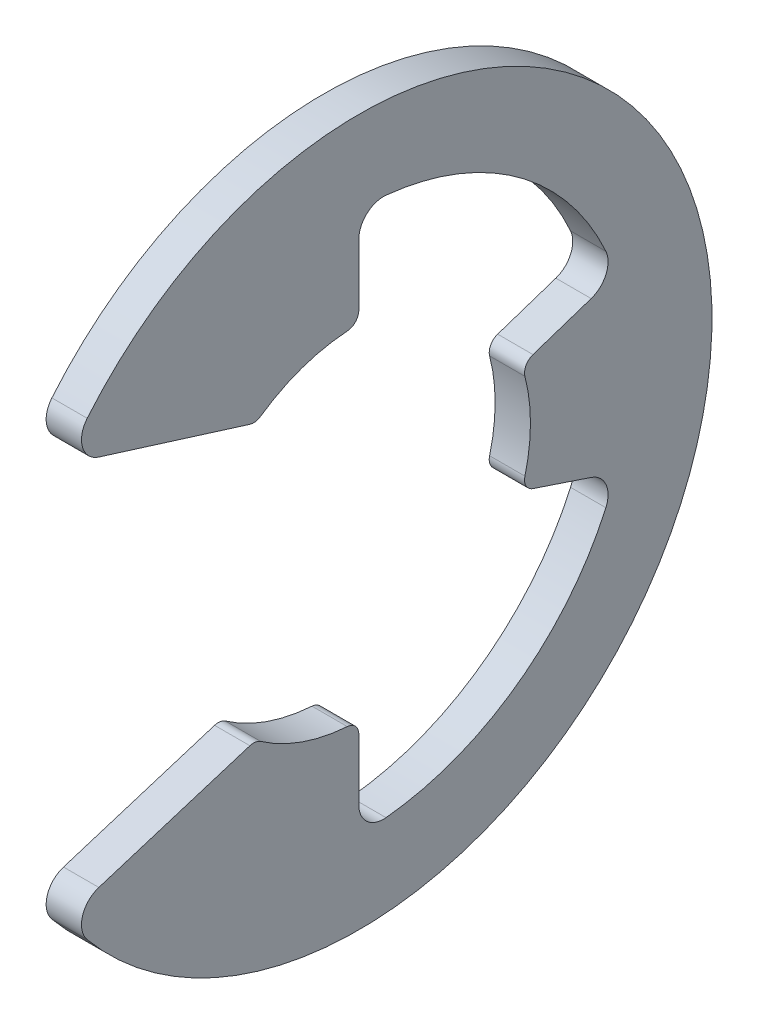
ISO-10303-21;
HEADER;
FILE_DESCRIPTION(('STEP AP214'),'2;1');
FILE_NAME('part.step','',(''),(''),'','','');
FILE_SCHEMA(('AUTOMOTIVE_DESIGN { 1 0 10303 214 1 1 1 1 }'));
ENDSEC;
DATA;
#1=APPLICATION_CONTEXT('core data for automotive mechanical design processes');
#2=APPLICATION_PROTOCOL_DEFINITION('international standard','automotive_design',2000,#1);
#3=PRODUCT_CONTEXT('',#1,'mechanical');
#4=PRODUCT('Part','Part','',(#3));
#5=PRODUCT_RELATED_PRODUCT_CATEGORY('part','',(#4));
#6=PRODUCT_DEFINITION_FORMATION('','',#4);
#7=PRODUCT_DEFINITION_CONTEXT('part definition',#1,'design');
#8=PRODUCT_DEFINITION('design','',#6,#7);
#9=PRODUCT_DEFINITION_SHAPE('','',#8);
#10=(LENGTH_UNIT() NAMED_UNIT(*) SI_UNIT(.MILLI.,.METRE.));
#11=(NAMED_UNIT(*) PLANE_ANGLE_UNIT() SI_UNIT($,.RADIAN.));
#12=(NAMED_UNIT(*) SI_UNIT($,.STERADIAN.) SOLID_ANGLE_UNIT());
#13=UNCERTAINTY_MEASURE_WITH_UNIT(LENGTH_MEASURE(1.E-05),#10,'distance_accuracy_value','');
#14=(GEOMETRIC_REPRESENTATION_CONTEXT(3) GLOBAL_UNCERTAINTY_ASSIGNED_CONTEXT((#13)) GLOBAL_UNIT_ASSIGNED_CONTEXT((#10,
#11,#12)) REPRESENTATION_CONTEXT('',''));
#15=CARTESIAN_POINT('',(0.,0.,0.));
#16=DIRECTION('',(0.,0.,1.));
#17=DIRECTION('',(1.,0.,0.));
#18=AXIS2_PLACEMENT_3D('',#15,#16,#17);
#19=CARTESIAN_POINT('',(0.3175,0.,0.));
#20=DIRECTION('',(-1.,0.,0.));
#21=DIRECTION('',(0.,0.,1.));
#22=AXIS2_PLACEMENT_3D('',#19,#20,#21);
#23=CYLINDRICAL_SURFACE('',#22,3.0861);
#24=CARTESIAN_POINT('',(0.3175,0.,0.));
#25=DIRECTION('',(-1.,0.,0.));
#26=DIRECTION('',(0.,0.,-1.));
#27=AXIS2_PLACEMENT_3D('',#24,#25,#26);
#28=CIRCLE('',#27,3.0861);
#29=CARTESIAN_POINT('',(0.3175,0.777025279538533,-2.98667790780293));
#30=VERTEX_POINT('',#29);
#31=CARTESIAN_POINT('',(0.3175,-0.777025279538533,-2.98667790780293));
#32=VERTEX_POINT('',#31);
#33=EDGE_CURVE('E263',#30,#32,#28,.T.);
#34=ORIENTED_EDGE('',*,*,#33,.F.);
#35=DIRECTION('',(-1.,0.,0.));
#36=VECTOR('',#35,1.);
#37=CARTESIAN_POINT('',(0.3175,0.777025279538533,-2.98667790780293));
#38=LINE('',#37,#36);
#39=CARTESIAN_POINT('',(-0.3175,0.777025279538533,-2.98667790780293));
#40=VERTEX_POINT('',#39);
#41=EDGE_CURVE('E428',#30,#40,#38,.T.);
#42=ORIENTED_EDGE('',*,*,#41,.T.);
#43=CARTESIAN_POINT('',(-0.3175,0.,0.));
#44=DIRECTION('',(-1.,0.,0.));
#45=DIRECTION('',(0.,0.,-1.));
#46=AXIS2_PLACEMENT_3D('',#43,#44,#45);
#47=CIRCLE('',#46,3.0861);
#48=CARTESIAN_POINT('',(-0.3175,-0.777025279538533,-2.98667790780293));
#49=VERTEX_POINT('',#48);
#50=EDGE_CURVE('E494',#40,#49,#47,.T.);
#51=ORIENTED_EDGE('',*,*,#50,.T.);
#52=DIRECTION('',(-1.,0.,0.));
#53=VECTOR('',#52,1.);
#54=CARTESIAN_POINT('',(0.3175,-0.777025279538533,-2.98667790780293));
#55=LINE('',#54,#53);
#56=EDGE_CURVE('E67',#49,#32,#55,.F.);
#57=ORIENTED_EDGE('',*,*,#56,.T.);
#58=EDGE_LOOP('',(#34,#42,#51,#57));
#59=FACE_BOUND('',#58,.T.);
#60=ADVANCED_FACE('F43',(#59),#23,.F.);
#61=CARTESIAN_POINT('',(0.3175,-0.975910508704563,-2.92773152611369));
#62=DIRECTION('',(0.,0.948683298050514,-0.316227766016838));
#63=DIRECTION('',(0.,0.316227766016838,0.948683298050514));
#64=AXIS2_PLACEMENT_3D('',#61,#62,#63);
#65=PLANE('',#64);
#66=DIRECTION('',(0.,-0.316227766016838,-0.948683298050514));
#67=VECTOR('',#66,1.);
#68=CARTESIAN_POINT('',(0.3175,-0.975910508704563,-2.92773152611369));
#69=LINE('',#68,#67);
#70=CARTESIAN_POINT('',(0.3175,-1.04382875319661,-3.13148625958984));
#71=VERTEX_POINT('',#70);
#72=CARTESIAN_POINT('',(0.3175,-1.39246687510636,-4.17740062531908));
#73=VERTEX_POINT('',#72);
#74=EDGE_CURVE('E266',#71,#73,#69,.T.);
#75=ORIENTED_EDGE('',*,*,#74,.F.);
#76=DIRECTION('',(-1.,0.,0.));
#77=VECTOR('',#76,1.);
#78=CARTESIAN_POINT('',(0.3175,-1.04382875319661,-3.13148625958984));
#79=LINE('',#78,#77);
#80=CARTESIAN_POINT('',(-0.3175,-1.04382875319661,-3.13148625958984));
#81=VERTEX_POINT('',#80);
#82=EDGE_CURVE('E435',#71,#81,#79,.T.);
#83=ORIENTED_EDGE('',*,*,#82,.T.);
#84=DIRECTION('',(0.,-0.316227766016838,-0.948683298050514));
#85=VECTOR('',#84,1.);
#86=CARTESIAN_POINT('',(-0.3175,-0.975910508704563,-2.92773152611369));
#87=LINE('',#86,#85);
#88=CARTESIAN_POINT('',(-0.3175,-1.39246687510636,-4.17740062531908));
#89=VERTEX_POINT('',#88);
#90=EDGE_CURVE('E497',#81,#89,#87,.T.);
#91=ORIENTED_EDGE('',*,*,#90,.T.);
#92=DIRECTION('',(1.,0.,0.));
#93=VECTOR('',#92,1.);
#94=CARTESIAN_POINT('',(0.3175,-1.39246687510636,-4.17740062531908));
#95=LINE('',#94,#93);
#96=EDGE_CURVE('E332',#89,#73,#95,.T.);
#97=ORIENTED_EDGE('',*,*,#96,.T.);
#98=EDGE_LOOP('',(#75,#83,#91,#97));
#99=FACE_BOUND('',#98,.T.);
#100=ADVANCED_FACE('F539',(#99),#65,.F.);
#101=CARTESIAN_POINT('',(0.3175,0.,0.));
#102=DIRECTION('',(-1.,0.,0.));
#103=DIRECTION('',(0.,0.,1.));
#104=AXIS2_PLACEMENT_3D('',#101,#102,#103);
#105=CYLINDRICAL_SURFACE('',#104,4.87024516129032);
#106=CARTESIAN_POINT('',(-0.3175,0.,0.));
#107=DIRECTION('',(-1.,0.,0.));
#108=DIRECTION('',(0.,0.,-1.));
#109=AXIS2_PLACEMENT_3D('',#106,#107,#108);
#110=CIRCLE('',#109,4.87024516129032);
#111=CARTESIAN_POINT('',(-0.3175,-1.99636153603219,-4.44227740562462));
#112=VERTEX_POINT('',#111);
#113=CARTESIAN_POINT('',(-0.3175,-4.84561932872465,-0.489143386096454));
#114=VERTEX_POINT('',#113);
#115=EDGE_CURVE('E501',#112,#114,#110,.T.);
#116=ORIENTED_EDGE('',*,*,#115,.T.);
#117=DIRECTION('',(-1.,0.,0.));
#118=VECTOR('',#117,1.);
#119=CARTESIAN_POINT('',(0.3175,-4.84561932872465,-0.489143386096454));
#120=LINE('',#119,#118);
#121=CARTESIAN_POINT('',(0.3175,-4.84561932872465,-0.489143386096454));
#122=VERTEX_POINT('',#121);
#123=EDGE_CURVE('E329',#114,#122,#120,.F.);
#124=ORIENTED_EDGE('',*,*,#123,.T.);
#125=CARTESIAN_POINT('',(0.3175,0.,0.));
#126=DIRECTION('',(-1.,0.,0.));
#127=DIRECTION('',(0.,0.,-1.));
#128=AXIS2_PLACEMENT_3D('',#125,#126,#127);
#129=CIRCLE('',#128,4.87024516129032);
#130=CARTESIAN_POINT('',(0.3175,-1.99636153603219,-4.44227740562462));
#131=VERTEX_POINT('',#130);
#132=EDGE_CURVE('E269',#131,#122,#129,.T.);
#133=ORIENTED_EDGE('',*,*,#132,.F.);
#134=DIRECTION('',(-1.,0.,0.));
#135=VECTOR('',#134,1.);
#136=CARTESIAN_POINT('',(0.3175,-1.99636153603219,-4.44227740562462));
#137=LINE('',#136,#135);
#138=EDGE_CURVE('E325',#131,#112,#137,.T.);
#139=ORIENTED_EDGE('',*,*,#138,.T.);
#140=EDGE_LOOP('',(#116,#124,#133,#139));
#141=FACE_BOUND('',#140,.T.);
#142=ADVANCED_FACE('F544',(#141),#105,.F.);
#143=CARTESIAN_POINT('',(0.3175,-4.87024516129032,0.));
#144=DIRECTION('',(0.,0.,1.));
#145=DIRECTION('',(0.,-1.,0.));
#146=AXIS2_PLACEMENT_3D('',#143,#144,#145);
#147=PLANE('',#146);
#148=DIRECTION('',(0.,1.,0.));
#149=VECTOR('',#148,1.);
#150=CARTESIAN_POINT('',(-0.3175,-4.87024516129032,0.));
#151=LINE('',#150,#149);
#152=CARTESIAN_POINT('',(-0.3175,-4.40336689167331,0.));
#153=VERTEX_POINT('',#152);
#154=CARTESIAN_POINT('',(-0.3175,-3.30087634727507,0.));
#155=VERTEX_POINT('',#154);
#156=EDGE_CURVE('E507',#153,#155,#151,.T.);
#157=ORIENTED_EDGE('',*,*,#156,.T.);
#158=DIRECTION('',(-1.,0.,0.));
#159=VECTOR('',#158,1.);
#160=CARTESIAN_POINT('',(0.3175,-3.30087634727507,0.));
#161=LINE('',#160,#159);
#162=CARTESIAN_POINT('',(0.3175,-3.30087634727507,0.));
#163=VERTEX_POINT('',#162);
#164=EDGE_CURVE('E402',#155,#163,#161,.F.);
#165=ORIENTED_EDGE('',*,*,#164,.T.);
#166=DIRECTION('',(0.,1.,0.));
#167=VECTOR('',#166,1.);
#168=CARTESIAN_POINT('',(0.3175,-4.87024516129032,0.));
#169=LINE('',#168,#167);
#170=CARTESIAN_POINT('',(0.3175,-4.40336689167331,0.));
#171=VERTEX_POINT('',#170);
#172=EDGE_CURVE('E273',#171,#163,#169,.T.);
#173=ORIENTED_EDGE('',*,*,#172,.F.);
#174=DIRECTION('',(1.,0.,0.));
#175=VECTOR('',#174,1.);
#176=CARTESIAN_POINT('',(-0.3175,-4.40336689167331,0.));
#177=LINE('',#176,#175);
#178=EDGE_CURVE('E321',#171,#153,#177,.F.);
#179=ORIENTED_EDGE('',*,*,#178,.T.);
#180=EDGE_LOOP('',(#157,#165,#173,#179));
#181=FACE_BOUND('',#180,.T.);
#182=ADVANCED_FACE('F550',(#181),#147,.F.);
#183=CARTESIAN_POINT('',(0.3175,0.,0.));
#184=DIRECTION('',(-1.,0.,0.));
#185=DIRECTION('',(0.,0.,1.));
#186=AXIS2_PLACEMENT_3D('',#183,#184,#185);
#187=CYLINDRICAL_SURFACE('',#186,3.0861);
#188=CARTESIAN_POINT('',(0.3175,0.,0.));
#189=DIRECTION('',(-1.,0.,0.));
#190=DIRECTION('',(0.,0.,-1.));
#191=AXIS2_PLACEMENT_3D('',#188,#189,#190);
#192=CIRCLE('',#191,3.0861);
#193=CARTESIAN_POINT('',(0.3175,-3.07912841607617,0.207319577735125));
#194=VERTEX_POINT('',#193);
#195=CARTESIAN_POINT('',(0.3175,-2.53187030116757,1.76455263114072));
#196=VERTEX_POINT('',#195);
#197=EDGE_CURVE('E277',#194,#196,#192,.T.);
#198=ORIENTED_EDGE('',*,*,#197,.F.);
#199=DIRECTION('',(-1.,0.,0.));
#200=VECTOR('',#199,1.);
#201=CARTESIAN_POINT('',(0.3175,-3.07912841607617,0.207319577735125));
#202=LINE('',#201,#200);
#203=CARTESIAN_POINT('',(-0.3175,-3.07912841607617,0.207319577735125));
#204=VERTEX_POINT('',#203);
#205=EDGE_CURVE('E380',#194,#204,#202,.T.);
#206=ORIENTED_EDGE('',*,*,#205,.T.);
#207=CARTESIAN_POINT('',(-0.3175,0.,0.));
#208=DIRECTION('',(-1.,0.,0.));
#209=DIRECTION('',(0.,0.,-1.));
#210=AXIS2_PLACEMENT_3D('',#207,#208,#209);
#211=CIRCLE('',#210,3.0861);
#212=CARTESIAN_POINT('',(-0.3175,-2.53187030116757,1.76455263114072));
#213=VERTEX_POINT('',#212);
#214=EDGE_CURVE('E245',#204,#213,#211,.T.);
#215=ORIENTED_EDGE('',*,*,#214,.T.);
#216=DIRECTION('',(-1.,0.,0.));
#217=VECTOR('',#216,1.);
#218=CARTESIAN_POINT('',(0.3175,-2.53187030116757,1.76455263114072));
#219=LINE('',#218,#217);
#220=EDGE_CURVE('E377',#213,#196,#219,.F.);
#221=ORIENTED_EDGE('',*,*,#220,.T.);
#222=EDGE_LOOP('',(#198,#206,#215,#221));
#223=FACE_BOUND('',#222,.T.);
#224=ADVANCED_FACE('F516',(#223),#187,.F.);
#225=CARTESIAN_POINT('',(0.3175,-2.46888,1.85166));
#226=DIRECTION('',(0.,-0.954513538836348,-0.29816757734219));
#227=DIRECTION('',(0.,0.29816757734219,-0.954513538836348));
#228=AXIS2_PLACEMENT_3D('',#225,#226,#227);
#229=PLANE('',#228);
#230=DIRECTION('',(0.,-0.29816757734219,0.954513538836348));
#231=VECTOR('',#230,1.);
#232=CARTESIAN_POINT('',(0.3175,-2.46888,1.85166));
#233=LINE('',#232,#231);
#234=CARTESIAN_POINT('',(0.3175,-2.50206600572264,1.957897210781));
#235=VERTEX_POINT('',#234);
#236=CARTESIAN_POINT('',(0.3175,-3.35053887647162,4.67408402654531));
#237=VERTEX_POINT('',#236);
#238=EDGE_CURVE('E281',#235,#237,#233,.T.);
#239=ORIENTED_EDGE('',*,*,#238,.F.);
#240=DIRECTION('',(-1.,0.,0.));
#241=VECTOR('',#240,1.);
#242=CARTESIAN_POINT('',(0.3175,-2.50206600572264,1.957897210781));
#243=LINE('',#242,#241);
#244=CARTESIAN_POINT('',(-0.3175,-2.50206600572264,1.957897210781));
#245=VERTEX_POINT('',#244);
#246=EDGE_CURVE('E422',#235,#245,#243,.T.);
#247=ORIENTED_EDGE('',*,*,#246,.T.);
#248=DIRECTION('',(0.,-0.29816757734219,0.954513538836348));
#249=VECTOR('',#248,1.);
#250=CARTESIAN_POINT('',(-0.3175,-2.46888,1.85166));
#251=LINE('',#250,#249);
#252=CARTESIAN_POINT('',(-0.3175,-3.35053887647162,4.67408402654531));
#253=VERTEX_POINT('',#252);
#254=EDGE_CURVE('E237',#245,#253,#251,.T.);
#255=ORIENTED_EDGE('',*,*,#254,.T.);
#256=DIRECTION('',(-1.,0.,0.));
#257=VECTOR('',#256,1.);
#258=CARTESIAN_POINT('',(0.3175,-3.35053887647162,4.67408402654531));
#259=LINE('',#258,#257);
#260=EDGE_CURVE('E214',#253,#237,#259,.F.);
#261=ORIENTED_EDGE('',*,*,#260,.T.);
#262=EDGE_LOOP('',(#239,#247,#255,#261));
#263=FACE_BOUND('',#262,.T.);
#264=ADVANCED_FACE('F524',(#263),#229,.F.);
#265=CARTESIAN_POINT('',(0.3175,0.,0.));
#266=DIRECTION('',(-1.,0.,0.));
#267=DIRECTION('',(0.,0.,1.));
#268=AXIS2_PLACEMENT_3D('',#265,#266,#267);
#269=CYLINDRICAL_SURFACE('',#268,6.35);
#270=CARTESIAN_POINT('',(0.3175,0.,0.));
#271=DIRECTION('',(1.,0.,0.));
#272=DIRECTION('',(0.,0.,-1.));
#273=AXIS2_PLACEMENT_3D('',#270,#271,#272);
#274=CIRCLE('',#273,6.35);
#275=CARTESIAN_POINT('',(0.3175,-4.05894639191868,4.88338552517926));
#276=VERTEX_POINT('',#275);
#277=CARTESIAN_POINT('',(0.3175,4.05894639191868,4.88338552517926));
#278=VERTEX_POINT('',#277);
#279=EDGE_CURVE('E228',#276,#278,#274,.T.);
#280=ORIENTED_EDGE('',*,*,#279,.F.);
#281=DIRECTION('',(-1.,0.,0.));
#282=VECTOR('',#281,1.);
#283=CARTESIAN_POINT('',(0.3175,-4.05894639191868,4.88338552517926));
#284=LINE('',#283,#282);
#285=CARTESIAN_POINT('',(-0.3175,-4.05894639191868,4.88338552517926));
#286=VERTEX_POINT('',#285);
#287=EDGE_CURVE('E212',#276,#286,#284,.T.);
#288=ORIENTED_EDGE('',*,*,#287,.T.);
#289=CARTESIAN_POINT('',(-0.3175,0.,0.));
#290=DIRECTION('',(1.,0.,0.));
#291=DIRECTION('',(0.,0.,-1.));
#292=AXIS2_PLACEMENT_3D('',#289,#290,#291);
#293=CIRCLE('',#292,6.35);
#294=CARTESIAN_POINT('',(-0.3175,4.05894639191868,4.88338552517926));
#295=VERTEX_POINT('',#294);
#296=EDGE_CURVE('E225',#286,#295,#293,.T.);
#297=ORIENTED_EDGE('',*,*,#296,.T.);
#298=DIRECTION('',(-1.,0.,0.));
#299=VECTOR('',#298,1.);
#300=CARTESIAN_POINT('',(0.3175,4.05894639191868,4.88338552517926));
#301=LINE('',#300,#299);
#302=EDGE_CURVE('E230',#295,#278,#301,.F.);
#303=ORIENTED_EDGE('',*,*,#302,.T.);
#304=EDGE_LOOP('',(#280,#288,#297,#303));
#305=FACE_BOUND('',#304,.T.);
#306=ADVANCED_FACE('F224',(#305),#269,.T.);
#307=CARTESIAN_POINT('',(0.3175,3.53770382148177,5.27324868287788));
#308=DIRECTION('',(0.,0.954513538836349,-0.298167577342189));
#309=DIRECTION('',(0.,0.298167577342189,0.954513538836349));
#310=AXIS2_PLACEMENT_3D('',#307,#308,#309);
#311=PLANE('',#310);
#312=DIRECTION('',(0.,-0.298167577342189,-0.954513538836349));
#313=VECTOR('',#312,1.);
#314=CARTESIAN_POINT('',(-0.3175,3.53770382148177,5.27324868287788));
#315=LINE('',#314,#313);
#316=CARTESIAN_POINT('',(-0.3175,3.35053887647162,4.67408402654532));
#317=VERTEX_POINT('',#316);
#318=CARTESIAN_POINT('',(-0.3175,2.50206600572264,1.957897210781));
#319=VERTEX_POINT('',#318);
#320=EDGE_CURVE('E236',#317,#319,#315,.T.);
#321=ORIENTED_EDGE('',*,*,#320,.T.);
#322=DIRECTION('',(-1.,0.,0.));
#323=VECTOR('',#322,1.);
#324=CARTESIAN_POINT('',(0.3175,2.50206600572264,1.957897210781));
#325=LINE('',#324,#323);
#326=CARTESIAN_POINT('',(0.3175,2.50206600572264,1.957897210781));
#327=VERTEX_POINT('',#326);
#328=EDGE_CURVE('E52',#319,#327,#325,.F.);
#329=ORIENTED_EDGE('',*,*,#328,.T.);
#330=DIRECTION('',(0.,-0.298167577342189,-0.954513538836349));
#331=VECTOR('',#330,1.);
#332=CARTESIAN_POINT('',(0.3175,3.53770382148177,5.27324868287788));
#333=LINE('',#332,#331);
#334=CARTESIAN_POINT('',(0.3175,3.35053887647162,4.67408402654532));
#335=VERTEX_POINT('',#334);
#336=EDGE_CURVE('E286',#335,#327,#333,.T.);
#337=ORIENTED_EDGE('',*,*,#336,.F.);
#338=DIRECTION('',(-1.,0.,0.));
#339=VECTOR('',#338,1.);
#340=CARTESIAN_POINT('',(0.3175,3.35053887647162,4.67408402654532));
#341=LINE('',#340,#339);
#342=EDGE_CURVE('E317',#335,#317,#341,.T.);
#343=ORIENTED_EDGE('',*,*,#342,.T.);
#344=EDGE_LOOP('',(#321,#329,#337,#343));
#345=FACE_BOUND('',#344,.T.);
#346=ADVANCED_FACE('F450',(#345),#311,.F.);
#347=CARTESIAN_POINT('',(0.3175,0.,0.));
#348=DIRECTION('',(-1.,0.,0.));
#349=DIRECTION('',(0.,0.,1.));
#350=AXIS2_PLACEMENT_3D('',#347,#348,#349);
#351=CYLINDRICAL_SURFACE('',#350,3.0861);
#352=CARTESIAN_POINT('',(0.3175,0.,0.));
#353=DIRECTION('',(-1.,0.,0.));
#354=DIRECTION('',(0.,0.,-1.));
#355=AXIS2_PLACEMENT_3D('',#352,#353,#354);
#356=CIRCLE('',#355,3.0861);
#357=CARTESIAN_POINT('',(0.3175,2.53187030116757,1.76455263114072));
#358=VERTEX_POINT('',#357);
#359=CARTESIAN_POINT('',(0.3175,3.07912841607617,0.207319577735126));
#360=VERTEX_POINT('',#359);
#361=EDGE_CURVE('E290',#358,#360,#356,.T.);
#362=ORIENTED_EDGE('',*,*,#361,.F.);
#363=DIRECTION('',(-1.,0.,0.));
#364=VECTOR('',#363,1.);
#365=CARTESIAN_POINT('',(0.3175,2.53187030116757,1.76455263114072));
#366=LINE('',#365,#364);
#367=CARTESIAN_POINT('',(-0.3175,2.53187030116757,1.76455263114072));
#368=VERTEX_POINT('',#367);
#369=EDGE_CURVE('E442',#358,#368,#366,.T.);
#370=ORIENTED_EDGE('',*,*,#369,.T.);
#371=CARTESIAN_POINT('',(-0.3175,0.,0.));
#372=DIRECTION('',(-1.,0.,0.));
#373=DIRECTION('',(0.,0.,-1.));
#374=AXIS2_PLACEMENT_3D('',#371,#372,#373);
#375=CIRCLE('',#374,3.0861);
#376=CARTESIAN_POINT('',(-0.3175,3.07912841607617,0.207319577735126));
#377=VERTEX_POINT('',#376);
#378=EDGE_CURVE('E243',#368,#377,#375,.T.);
#379=ORIENTED_EDGE('',*,*,#378,.T.);
#380=DIRECTION('',(-1.,0.,0.));
#381=VECTOR('',#380,1.);
#382=CARTESIAN_POINT('',(0.3175,3.07912841607617,0.207319577735126));
#383=LINE('',#382,#381);
#384=EDGE_CURVE('E439',#377,#360,#383,.F.);
#385=ORIENTED_EDGE('',*,*,#384,.T.);
#386=EDGE_LOOP('',(#362,#370,#379,#385));
#387=FACE_BOUND('',#386,.T.);
#388=ADVANCED_FACE('F461',(#387),#351,.F.);
#389=CARTESIAN_POINT('',(0.3175,3.0861,0.));
#390=DIRECTION('',(0.,0.,1.));
#391=DIRECTION('',(0.,-1.,0.));
#392=AXIS2_PLACEMENT_3D('',#389,#390,#391);
#393=PLANE('',#392);
#394=DIRECTION('',(0.,1.,0.));
#395=VECTOR('',#394,1.);
#396=CARTESIAN_POINT('',(0.3175,3.0861,0.));
#397=LINE('',#396,#395);
#398=CARTESIAN_POINT('',(0.3175,3.30087634727507,0.));
#399=VERTEX_POINT('',#398);
#400=CARTESIAN_POINT('',(0.3175,4.40336689167331,0.));
#401=VERTEX_POINT('',#400);
#402=EDGE_CURVE('E294',#399,#401,#397,.T.);
#403=ORIENTED_EDGE('',*,*,#402,.F.);
#404=DIRECTION('',(-1.,0.,0.));
#405=VECTOR('',#404,1.);
#406=CARTESIAN_POINT('',(0.3175,3.30087634727507,0.));
#407=LINE('',#406,#405);
#408=CARTESIAN_POINT('',(-0.3175,3.30087634727507,0.));
#409=VERTEX_POINT('',#408);
#410=EDGE_CURVE('E11',#399,#409,#407,.T.);
#411=ORIENTED_EDGE('',*,*,#410,.T.);
#412=DIRECTION('',(0.,1.,0.));
#413=VECTOR('',#412,1.);
#414=CARTESIAN_POINT('',(-0.3175,3.0861,0.));
#415=LINE('',#414,#413);
#416=CARTESIAN_POINT('',(-0.3175,4.40336689167331,0.));
#417=VERTEX_POINT('',#416);
#418=EDGE_CURVE('E252',#409,#417,#415,.T.);
#419=ORIENTED_EDGE('',*,*,#418,.T.);
#420=DIRECTION('',(1.,0.,0.));
#421=VECTOR('',#420,1.);
#422=CARTESIAN_POINT('',(0.3175,4.40336689167331,0.));
#423=LINE('',#422,#421);
#424=EDGE_CURVE('E347',#417,#401,#423,.T.);
#425=ORIENTED_EDGE('',*,*,#424,.T.);
#426=EDGE_LOOP('',(#403,#411,#419,#425));
#427=FACE_BOUND('',#426,.T.);
#428=ADVANCED_FACE('F469',(#427),#393,.F.);
#429=CARTESIAN_POINT('',(0.3175,0.,0.));
#430=DIRECTION('',(-1.,0.,0.));
#431=DIRECTION('',(0.,0.,1.));
#432=AXIS2_PLACEMENT_3D('',#429,#430,#431);
#433=CYLINDRICAL_SURFACE('',#432,4.87024516129032);
#434=CARTESIAN_POINT('',(-0.3175,0.,0.));
#435=DIRECTION('',(-1.,0.,0.));
#436=DIRECTION('',(0.,0.,-1.));
#437=AXIS2_PLACEMENT_3D('',#434,#435,#436);
#438=CIRCLE('',#437,4.87024516129032);
#439=CARTESIAN_POINT('',(-0.3175,4.84561932872465,-0.489143386096454));
#440=VERTEX_POINT('',#439);
#441=CARTESIAN_POINT('',(-0.3175,1.99636153603219,-4.44227740562462));
#442=VERTEX_POINT('',#441);
#443=EDGE_CURVE('E255',#440,#442,#438,.T.);
#444=ORIENTED_EDGE('',*,*,#443,.T.);
#445=DIRECTION('',(-1.,0.,0.));
#446=VECTOR('',#445,1.);
#447=CARTESIAN_POINT('',(0.3175,1.99636153603219,-4.44227740562462));
#448=LINE('',#447,#446);
#449=CARTESIAN_POINT('',(0.3175,1.99636153603219,-4.44227740562462));
#450=VERTEX_POINT('',#449);
#451=EDGE_CURVE('E344',#442,#450,#448,.F.);
#452=ORIENTED_EDGE('',*,*,#451,.T.);
#453=CARTESIAN_POINT('',(0.3175,0.,0.));
#454=DIRECTION('',(-1.,0.,0.));
#455=DIRECTION('',(0.,0.,-1.));
#456=AXIS2_PLACEMENT_3D('',#453,#454,#455);
#457=CIRCLE('',#456,4.87024516129032);
#458=CARTESIAN_POINT('',(0.3175,4.84561932872465,-0.489143386096454));
#459=VERTEX_POINT('',#458);
#460=EDGE_CURVE('E297',#459,#450,#457,.T.);
#461=ORIENTED_EDGE('',*,*,#460,.F.);
#462=DIRECTION('',(-1.,0.,0.));
#463=VECTOR('',#462,1.);
#464=CARTESIAN_POINT('',(0.3175,4.84561932872465,-0.489143386096454));
#465=LINE('',#464,#463);
#466=EDGE_CURVE('E340',#459,#440,#465,.T.);
#467=ORIENTED_EDGE('',*,*,#466,.T.);
#468=EDGE_LOOP('',(#444,#452,#461,#467));
#469=FACE_BOUND('',#468,.T.);
#470=ADVANCED_FACE('F477',(#469),#433,.F.);
#471=CARTESIAN_POINT('',(0.3175,1.54010674730915,-4.62032024192746));
#472=DIRECTION('',(0.,-0.948683298050514,-0.316227766016838));
#473=DIRECTION('',(0.,0.316227766016838,-0.948683298050514));
#474=AXIS2_PLACEMENT_3D('',#471,#472,#473);
#475=PLANE('',#474);
#476=DIRECTION('',(0.,-0.316227766016838,0.948683298050514));
#477=VECTOR('',#476,1.);
#478=CARTESIAN_POINT('',(-0.3175,1.54010674730915,-4.62032024192746));
#479=LINE('',#478,#477);
#480=CARTESIAN_POINT('',(-0.3175,1.39246687510636,-4.17740062531908));
#481=VERTEX_POINT('',#480);
#482=CARTESIAN_POINT('',(-0.3175,1.04382875319662,-3.13148625958985));
#483=VERTEX_POINT('',#482);
#484=EDGE_CURVE('E259',#481,#483,#479,.T.);
#485=ORIENTED_EDGE('',*,*,#484,.T.);
#486=DIRECTION('',(-1.,0.,0.));
#487=VECTOR('',#486,1.);
#488=CARTESIAN_POINT('',(0.3175,1.04382875319662,-3.13148625958985));
#489=LINE('',#488,#487);
#490=CARTESIAN_POINT('',(0.3175,1.04382875319662,-3.13148625958985));
#491=VERTEX_POINT('',#490);
#492=EDGE_CURVE('E432',#483,#491,#489,.F.);
#493=ORIENTED_EDGE('',*,*,#492,.T.);
#494=DIRECTION('',(0.,-0.316227766016838,0.948683298050514));
#495=VECTOR('',#494,1.);
#496=CARTESIAN_POINT('',(0.3175,1.54010674730915,-4.62032024192746));
#497=LINE('',#496,#495);
#498=CARTESIAN_POINT('',(0.3175,1.39246687510636,-4.17740062531908));
#499=VERTEX_POINT('',#498);
#500=EDGE_CURVE('E301',#499,#491,#497,.T.);
#501=ORIENTED_EDGE('',*,*,#500,.F.);
#502=DIRECTION('',(1.,0.,0.));
#503=VECTOR('',#502,1.);
#504=CARTESIAN_POINT('',(-0.3175,1.39246687510636,-4.17740062531908));
#505=LINE('',#504,#503);
#506=EDGE_CURVE('E336',#499,#481,#505,.F.);
#507=ORIENTED_EDGE('',*,*,#506,.T.);
#508=EDGE_LOOP('',(#485,#493,#501,#507));
#509=FACE_BOUND('',#508,.T.);
#510=ADVANCED_FACE('F488',(#509),#475,.F.);
#511=CARTESIAN_POINT('',(0.3175,0.,0.));
#512=DIRECTION('',(1.,0.,0.));
#513=DIRECTION('',(0.,0.,-1.));
#514=AXIS2_PLACEMENT_3D('',#511,#512,#513);
#515=PLANE('',#514);
#516=ORIENTED_EDGE('',*,*,#172,.T.);
#517=CARTESIAN_POINT('',(0.3175,-3.30087634727507,0.22225));
#518=DIRECTION('',(1.,0.,0.));
#519=DIRECTION('',(0.,0.,-1.));
#520=AXIS2_PLACEMENT_3D('',#517,#518,#519);
#521=CIRCLE('',#520,0.22225);
#522=EDGE_CURVE('E419',#163,#194,#521,.T.);
#523=ORIENTED_EDGE('',*,*,#522,.T.);
#524=ORIENTED_EDGE('',*,*,#197,.T.);
#525=CARTESIAN_POINT('',(0.3175,-2.71420663972902,1.8916294667167));
#526=DIRECTION('',(1.,0.,0.));
#527=DIRECTION('',(0.,0.,-1.));
#528=AXIS2_PLACEMENT_3D('',#525,#526,#527);
#529=CIRCLE('',#528,0.22225);
#530=EDGE_CURVE('E416',#196,#235,#529,.T.);
#531=ORIENTED_EDGE('',*,*,#530,.T.);
#532=ORIENTED_EDGE('',*,*,#238,.T.);
#533=CARTESIAN_POINT('',(0.3175,-3.77482014448438,4.54154853841671));
#534=DIRECTION('',(1.,0.,0.));
#535=DIRECTION('',(0.,0.,-1.));
#536=AXIS2_PLACEMENT_3D('',#533,#534,#535);
#537=CIRCLE('',#536,0.4445);
#538=EDGE_CURVE('E314',#237,#276,#537,.T.);
#539=ORIENTED_EDGE('',*,*,#538,.T.);
#540=ORIENTED_EDGE('',*,*,#279,.T.);
#541=CARTESIAN_POINT('',(0.3175,3.77482014448437,4.54154853841671));
#542=DIRECTION('',(1.,0.,0.));
#543=DIRECTION('',(0.,0.,-1.));
#544=AXIS2_PLACEMENT_3D('',#541,#542,#543);
#545=CIRCLE('',#544,0.4445);
#546=EDGE_CURVE('E311',#278,#335,#545,.T.);
#547=ORIENTED_EDGE('',*,*,#546,.T.);
#548=ORIENTED_EDGE('',*,*,#336,.T.);
#549=CARTESIAN_POINT('',(0.3175,2.71420663972902,1.8916294667167));
#550=DIRECTION('',(1.,0.,0.));
#551=DIRECTION('',(0.,0.,-1.));
#552=AXIS2_PLACEMENT_3D('',#549,#550,#551);
#553=CIRCLE('',#552,0.22225);
#554=EDGE_CURVE('E408',#327,#358,#553,.T.);
#555=ORIENTED_EDGE('',*,*,#554,.T.);
#556=ORIENTED_EDGE('',*,*,#361,.T.);
#557=CARTESIAN_POINT('',(0.3175,3.30087634727507,0.222250000000001));
#558=DIRECTION('',(1.,0.,0.));
#559=DIRECTION('',(0.,0.,-1.));
#560=AXIS2_PLACEMENT_3D('',#557,#558,#559);
#561=CIRCLE('',#560,0.22225);
#562=EDGE_CURVE('E405',#360,#399,#561,.T.);
#563=ORIENTED_EDGE('',*,*,#562,.T.);
#564=ORIENTED_EDGE('',*,*,#402,.T.);
#565=CARTESIAN_POINT('',(0.3175,4.40336689167331,-0.444499999999999));
#566=DIRECTION('',(1.,0.,0.));
#567=DIRECTION('',(0.,0.,-1.));
#568=AXIS2_PLACEMENT_3D('',#565,#566,#567);
#569=CIRCLE('',#568,0.4445);
#570=EDGE_CURVE('E374',#401,#459,#569,.F.);
#571=ORIENTED_EDGE('',*,*,#570,.T.);
#572=ORIENTED_EDGE('',*,*,#460,.T.);
#573=CARTESIAN_POINT('',(0.3175,1.81415660108981,-4.0368373833246));
#574=DIRECTION('',(1.,0.,0.));
#575=DIRECTION('',(0.,0.,-1.));
#576=AXIS2_PLACEMENT_3D('',#573,#574,#575);
#577=CIRCLE('',#576,0.4445);
#578=EDGE_CURVE('E367',#450,#499,#577,.F.);
#579=ORIENTED_EDGE('',*,*,#578,.T.);
#580=ORIENTED_EDGE('',*,*,#500,.T.);
#581=CARTESIAN_POINT('',(0.3175,0.832983890204889,-3.20176788058709));
#582=DIRECTION('',(1.,0.,0.));
#583=DIRECTION('',(0.,0.,-1.));
#584=AXIS2_PLACEMENT_3D('',#581,#582,#583);
#585=CIRCLE('',#584,0.22225);
#586=EDGE_CURVE('E413',#491,#30,#585,.T.);
#587=ORIENTED_EDGE('',*,*,#586,.T.);
#588=ORIENTED_EDGE('',*,*,#33,.T.);
#589=CARTESIAN_POINT('',(0.3175,-0.832983890204888,-3.20176788058709));
#590=DIRECTION('',(1.,0.,0.));
#591=DIRECTION('',(0.,0.,-1.));
#592=AXIS2_PLACEMENT_3D('',#589,#590,#591);
#593=CIRCLE('',#592,0.22225);
#594=EDGE_CURVE('E59',#32,#71,#593,.T.);
#595=ORIENTED_EDGE('',*,*,#594,.T.);
#596=ORIENTED_EDGE('',*,*,#74,.T.);
#597=CARTESIAN_POINT('',(0.3175,-1.81415660108981,-4.03683738332459));
#598=DIRECTION('',(1.,0.,0.));
#599=DIRECTION('',(0.,0.,-1.));
#600=AXIS2_PLACEMENT_3D('',#597,#598,#599);
#601=CIRCLE('',#600,0.4445);
#602=EDGE_CURVE('E361',#73,#131,#601,.F.);
#603=ORIENTED_EDGE('',*,*,#602,.T.);
#604=ORIENTED_EDGE('',*,*,#132,.T.);
#605=CARTESIAN_POINT('',(0.3175,-4.40336689167331,-0.444499999999999));
#606=DIRECTION('',(1.,0.,0.));
#607=DIRECTION('',(0.,0.,-1.));
#608=AXIS2_PLACEMENT_3D('',#605,#606,#607);
#609=CIRCLE('',#608,0.4445);
#610=EDGE_CURVE('E354',#122,#171,#609,.F.);
#611=ORIENTED_EDGE('',*,*,#610,.T.);
#612=EDGE_LOOP('',(#516,#523,#524,#531,#532,#539,#540,#547,#548,#555,#556,#563,#564,#571,#572,
#579,#580,#587,#588,#595,#596,#603,#604,#611));
#613=FACE_BOUND('',#612,.T.);
#614=ADVANCED_FACE('F454',(#613),#515,.T.);
#615=CARTESIAN_POINT('',(-0.3175,0.,0.));
#616=DIRECTION('',(1.,0.,0.));
#617=DIRECTION('',(0.,0.,-1.));
#618=AXIS2_PLACEMENT_3D('',#615,#616,#617);
#619=PLANE('',#618);
#620=ORIENTED_EDGE('',*,*,#214,.F.);
#621=CARTESIAN_POINT('',(-0.3175,-3.30087634727507,0.22225));
#622=DIRECTION('',(1.,0.,0.));
#623=DIRECTION('',(0.,0.,-1.));
#624=AXIS2_PLACEMENT_3D('',#621,#622,#623);
#625=CIRCLE('',#624,0.22225);
#626=EDGE_CURVE('E399',#204,#155,#625,.F.);
#627=ORIENTED_EDGE('',*,*,#626,.T.);
#628=ORIENTED_EDGE('',*,*,#156,.F.);
#629=CARTESIAN_POINT('',(-0.3175,-4.40336689167331,-0.444499999999999));
#630=DIRECTION('',(1.,0.,0.));
#631=DIRECTION('',(0.,0.,-1.));
#632=AXIS2_PLACEMENT_3D('',#629,#630,#631);
#633=CIRCLE('',#632,0.4445);
#634=EDGE_CURVE('E351',#153,#114,#633,.T.);
#635=ORIENTED_EDGE('',*,*,#634,.T.);
#636=ORIENTED_EDGE('',*,*,#115,.F.);
#637=CARTESIAN_POINT('',(-0.3175,-1.81415660108981,-4.03683738332459));
#638=DIRECTION('',(1.,0.,0.));
#639=DIRECTION('',(0.,0.,-1.));
#640=AXIS2_PLACEMENT_3D('',#637,#638,#639);
#641=CIRCLE('',#640,0.4445);
#642=EDGE_CURVE('E357',#112,#89,#641,.T.);
#643=ORIENTED_EDGE('',*,*,#642,.T.);
#644=ORIENTED_EDGE('',*,*,#90,.F.);
#645=CARTESIAN_POINT('',(-0.3175,-0.832983890204888,-3.20176788058709));
#646=DIRECTION('',(1.,0.,0.));
#647=DIRECTION('',(0.,0.,-1.));
#648=AXIS2_PLACEMENT_3D('',#645,#646,#647);
#649=CIRCLE('',#648,0.22225);
#650=EDGE_CURVE('E390',#81,#49,#649,.F.);
#651=ORIENTED_EDGE('',*,*,#650,.T.);
#652=ORIENTED_EDGE('',*,*,#50,.F.);
#653=CARTESIAN_POINT('',(-0.3175,0.832983890204889,-3.20176788058709));
#654=DIRECTION('',(1.,0.,0.));
#655=DIRECTION('',(0.,0.,-1.));
#656=AXIS2_PLACEMENT_3D('',#653,#654,#655);
#657=CIRCLE('',#656,0.22225);
#658=EDGE_CURVE('E393',#40,#483,#657,.F.);
#659=ORIENTED_EDGE('',*,*,#658,.T.);
#660=ORIENTED_EDGE('',*,*,#484,.F.);
#661=CARTESIAN_POINT('',(-0.3175,1.81415660108981,-4.0368373833246));
#662=DIRECTION('',(1.,0.,0.));
#663=DIRECTION('',(0.,0.,-1.));
#664=AXIS2_PLACEMENT_3D('',#661,#662,#663);
#665=CIRCLE('',#664,0.4445);
#666=EDGE_CURVE('E364',#481,#442,#665,.T.);
#667=ORIENTED_EDGE('',*,*,#666,.T.);
#668=ORIENTED_EDGE('',*,*,#443,.F.);
#669=CARTESIAN_POINT('',(-0.3175,4.40336689167331,-0.444499999999999));
#670=DIRECTION('',(1.,0.,0.));
#671=DIRECTION('',(0.,0.,-1.));
#672=AXIS2_PLACEMENT_3D('',#669,#670,#671);
#673=CIRCLE('',#672,0.4445);
#674=EDGE_CURVE('E370',#440,#417,#673,.T.);
#675=ORIENTED_EDGE('',*,*,#674,.T.);
#676=ORIENTED_EDGE('',*,*,#418,.F.);
#677=CARTESIAN_POINT('',(-0.3175,3.30087634727507,0.222250000000001));
#678=DIRECTION('',(1.,0.,0.));
#679=DIRECTION('',(0.,0.,-1.));
#680=AXIS2_PLACEMENT_3D('',#677,#678,#679);
#681=CIRCLE('',#680,0.22225);
#682=EDGE_CURVE('E384',#409,#377,#681,.F.);
#683=ORIENTED_EDGE('',*,*,#682,.T.);
#684=ORIENTED_EDGE('',*,*,#378,.F.);
#685=CARTESIAN_POINT('',(-0.3175,2.71420663972902,1.8916294667167));
#686=DIRECTION('',(1.,0.,0.));
#687=DIRECTION('',(0.,0.,-1.));
#688=AXIS2_PLACEMENT_3D('',#685,#686,#687);
#689=CIRCLE('',#688,0.22225);
#690=EDGE_CURVE('E387',#368,#319,#689,.F.);
#691=ORIENTED_EDGE('',*,*,#690,.T.);
#692=ORIENTED_EDGE('',*,*,#320,.F.);
#693=CARTESIAN_POINT('',(-0.3175,3.77482014448437,4.54154853841671));
#694=DIRECTION('',(1.,0.,0.));
#695=DIRECTION('',(0.,0.,-1.));
#696=AXIS2_PLACEMENT_3D('',#693,#694,#695);
#697=CIRCLE('',#696,0.4445);
#698=EDGE_CURVE('E219',#317,#295,#697,.F.);
#699=ORIENTED_EDGE('',*,*,#698,.T.);
#700=ORIENTED_EDGE('',*,*,#296,.F.);
#701=CARTESIAN_POINT('',(-0.3175,-3.77482014448438,4.54154853841671));
#702=DIRECTION('',(1.,0.,0.));
#703=DIRECTION('',(0.,0.,-1.));
#704=AXIS2_PLACEMENT_3D('',#701,#702,#703);
#705=CIRCLE('',#704,0.4445);
#706=EDGE_CURVE('E208',#286,#253,#705,.F.);
#707=ORIENTED_EDGE('',*,*,#706,.T.);
#708=ORIENTED_EDGE('',*,*,#254,.F.);
#709=CARTESIAN_POINT('',(-0.3175,-2.71420663972902,1.8916294667167));
#710=DIRECTION('',(1.,0.,0.));
#711=DIRECTION('',(0.,0.,-1.));
#712=AXIS2_PLACEMENT_3D('',#709,#710,#711);
#713=CIRCLE('',#712,0.22225);
#714=EDGE_CURVE('E396',#245,#213,#713,.F.);
#715=ORIENTED_EDGE('',*,*,#714,.T.);
#716=EDGE_LOOP('',(#620,#627,#628,#635,#636,#643,#644,#651,#652,#659,#660,#667,#668,#675,#676,
#683,#684,#691,#692,#699,#700,#707,#708,#715));
#717=FACE_BOUND('',#716,.T.);
#718=ADVANCED_FACE('F233',(#717),#619,.F.);
#719=CARTESIAN_POINT('',(0.3175,-3.77482014448438,4.54154853841671));
#720=DIRECTION('',(-1.,0.,0.));
#721=DIRECTION('',(0.,0.,1.));
#722=AXIS2_PLACEMENT_3D('',#719,#720,#721);
#723=CYLINDRICAL_SURFACE('',#722,0.4445);
#724=ORIENTED_EDGE('',*,*,#538,.F.);
#725=ORIENTED_EDGE('',*,*,#260,.F.);
#726=ORIENTED_EDGE('',*,*,#706,.F.);
#727=ORIENTED_EDGE('',*,*,#287,.F.);
#728=EDGE_LOOP('',(#724,#725,#726,#727));
#729=FACE_BOUND('',#728,.T.);
#730=ADVANCED_FACE('F211',(#729),#723,.T.);
#731=CARTESIAN_POINT('',(0.3175,3.77482014448437,4.54154853841671));
#732=DIRECTION('',(-1.,0.,0.));
#733=DIRECTION('',(0.,0.,1.));
#734=AXIS2_PLACEMENT_3D('',#731,#732,#733);
#735=CYLINDRICAL_SURFACE('',#734,0.4445);
#736=ORIENTED_EDGE('',*,*,#546,.F.);
#737=ORIENTED_EDGE('',*,*,#302,.F.);
#738=ORIENTED_EDGE('',*,*,#698,.F.);
#739=ORIENTED_EDGE('',*,*,#342,.F.);
#740=EDGE_LOOP('',(#736,#737,#738,#739));
#741=FACE_BOUND('',#740,.T.);
#742=ADVANCED_FACE('F526',(#741),#735,.T.);
#743=CARTESIAN_POINT('',(0.3175,-4.40336689167331,-0.444499999999999));
#744=DIRECTION('',(-1.,0.,0.));
#745=DIRECTION('',(0.,0.,1.));
#746=AXIS2_PLACEMENT_3D('',#743,#744,#745);
#747=CYLINDRICAL_SURFACE('',#746,0.4445);
#748=ORIENTED_EDGE('',*,*,#610,.F.);
#749=ORIENTED_EDGE('',*,*,#123,.F.);
#750=ORIENTED_EDGE('',*,*,#634,.F.);
#751=ORIENTED_EDGE('',*,*,#178,.F.);
#752=EDGE_LOOP('',(#748,#749,#750,#751));
#753=FACE_BOUND('',#752,.T.);
#754=ADVANCED_FACE('F528',(#753),#747,.F.);
#755=CARTESIAN_POINT('',(0.3175,-1.81415660108981,-4.03683738332459));
#756=DIRECTION('',(-1.,0.,0.));
#757=DIRECTION('',(0.,0.,1.));
#758=AXIS2_PLACEMENT_3D('',#755,#756,#757);
#759=CYLINDRICAL_SURFACE('',#758,0.4445);
#760=ORIENTED_EDGE('',*,*,#602,.F.);
#761=ORIENTED_EDGE('',*,*,#96,.F.);
#762=ORIENTED_EDGE('',*,*,#642,.F.);
#763=ORIENTED_EDGE('',*,*,#138,.F.);
#764=EDGE_LOOP('',(#760,#761,#762,#763));
#765=FACE_BOUND('',#764,.T.);
#766=ADVANCED_FACE('F534',(#765),#759,.F.);
#767=CARTESIAN_POINT('',(0.3175,1.81415660108981,-4.0368373833246));
#768=DIRECTION('',(-1.,0.,0.));
#769=DIRECTION('',(0.,0.,1.));
#770=AXIS2_PLACEMENT_3D('',#767,#768,#769);
#771=CYLINDRICAL_SURFACE('',#770,0.4445);
#772=ORIENTED_EDGE('',*,*,#578,.F.);
#773=ORIENTED_EDGE('',*,*,#451,.F.);
#774=ORIENTED_EDGE('',*,*,#666,.F.);
#775=ORIENTED_EDGE('',*,*,#506,.F.);
#776=EDGE_LOOP('',(#772,#773,#774,#775));
#777=FACE_BOUND('',#776,.T.);
#778=ADVANCED_FACE('F483',(#777),#771,.F.);
#779=CARTESIAN_POINT('',(0.3175,4.40336689167331,-0.444499999999999));
#780=DIRECTION('',(-1.,0.,0.));
#781=DIRECTION('',(0.,0.,1.));
#782=AXIS2_PLACEMENT_3D('',#779,#780,#781);
#783=CYLINDRICAL_SURFACE('',#782,0.4445);
#784=ORIENTED_EDGE('',*,*,#570,.F.);
#785=ORIENTED_EDGE('',*,*,#424,.F.);
#786=ORIENTED_EDGE('',*,*,#674,.F.);
#787=ORIENTED_EDGE('',*,*,#466,.F.);
#788=EDGE_LOOP('',(#784,#785,#786,#787));
#789=FACE_BOUND('',#788,.T.);
#790=ADVANCED_FACE('F480',(#789),#783,.F.);
#791=CARTESIAN_POINT('',(0.3175,-3.30087634727507,0.22225));
#792=DIRECTION('',(-1.,0.,0.));
#793=DIRECTION('',(0.,0.,1.));
#794=AXIS2_PLACEMENT_3D('',#791,#792,#793);
#795=CYLINDRICAL_SURFACE('',#794,0.22225);
#796=ORIENTED_EDGE('',*,*,#522,.F.);
#797=ORIENTED_EDGE('',*,*,#164,.F.);
#798=ORIENTED_EDGE('',*,*,#626,.F.);
#799=ORIENTED_EDGE('',*,*,#205,.F.);
#800=EDGE_LOOP('',(#796,#797,#798,#799));
#801=FACE_BOUND('',#800,.T.);
#802=ADVANCED_FACE('F622',(#801),#795,.T.);
#803=CARTESIAN_POINT('',(0.3175,-2.71420663972902,1.8916294667167));
#804=DIRECTION('',(-1.,0.,0.));
#805=DIRECTION('',(0.,0.,1.));
#806=AXIS2_PLACEMENT_3D('',#803,#804,#805);
#807=CYLINDRICAL_SURFACE('',#806,0.22225);
#808=ORIENTED_EDGE('',*,*,#530,.F.);
#809=ORIENTED_EDGE('',*,*,#220,.F.);
#810=ORIENTED_EDGE('',*,*,#714,.F.);
#811=ORIENTED_EDGE('',*,*,#246,.F.);
#812=EDGE_LOOP('',(#808,#809,#810,#811));
#813=FACE_BOUND('',#812,.T.);
#814=ADVANCED_FACE('F520',(#813),#807,.T.);
#815=CARTESIAN_POINT('',(0.3175,0.832983890204889,-3.20176788058709));
#816=DIRECTION('',(-1.,0.,0.));
#817=DIRECTION('',(0.,0.,1.));
#818=AXIS2_PLACEMENT_3D('',#815,#816,#817);
#819=CYLINDRICAL_SURFACE('',#818,0.22225);
#820=ORIENTED_EDGE('',*,*,#586,.F.);
#821=ORIENTED_EDGE('',*,*,#492,.F.);
#822=ORIENTED_EDGE('',*,*,#658,.F.);
#823=ORIENTED_EDGE('',*,*,#41,.F.);
#824=EDGE_LOOP('',(#820,#821,#822,#823));
#825=FACE_BOUND('',#824,.T.);
#826=ADVANCED_FACE('F491',(#825),#819,.T.);
#827=CARTESIAN_POINT('',(0.3175,-0.832983890204888,-3.20176788058709));
#828=DIRECTION('',(-1.,0.,0.));
#829=DIRECTION('',(0.,0.,1.));
#830=AXIS2_PLACEMENT_3D('',#827,#828,#829);
#831=CYLINDRICAL_SURFACE('',#830,0.22225);
#832=ORIENTED_EDGE('',*,*,#594,.F.);
#833=ORIENTED_EDGE('',*,*,#56,.F.);
#834=ORIENTED_EDGE('',*,*,#650,.F.);
#835=ORIENTED_EDGE('',*,*,#82,.F.);
#836=EDGE_LOOP('',(#832,#833,#834,#835));
#837=FACE_BOUND('',#836,.T.);
#838=ADVANCED_FACE('F715',(#837),#831,.T.);
#839=CARTESIAN_POINT('',(0.3175,2.71420663972902,1.8916294667167));
#840=DIRECTION('',(-1.,0.,0.));
#841=DIRECTION('',(0.,0.,1.));
#842=AXIS2_PLACEMENT_3D('',#839,#840,#841);
#843=CYLINDRICAL_SURFACE('',#842,0.22225);
#844=ORIENTED_EDGE('',*,*,#554,.F.);
#845=ORIENTED_EDGE('',*,*,#328,.F.);
#846=ORIENTED_EDGE('',*,*,#690,.F.);
#847=ORIENTED_EDGE('',*,*,#369,.F.);
#848=EDGE_LOOP('',(#844,#845,#846,#847));
#849=FACE_BOUND('',#848,.T.);
#850=ADVANCED_FACE('F458',(#849),#843,.T.);
#851=CARTESIAN_POINT('',(0.3175,3.30087634727507,0.222250000000001));
#852=DIRECTION('',(-1.,0.,0.));
#853=DIRECTION('',(0.,0.,1.));
#854=AXIS2_PLACEMENT_3D('',#851,#852,#853);
#855=CYLINDRICAL_SURFACE('',#854,0.22225);
#856=ORIENTED_EDGE('',*,*,#562,.F.);
#857=ORIENTED_EDGE('',*,*,#384,.F.);
#858=ORIENTED_EDGE('',*,*,#682,.F.);
#859=ORIENTED_EDGE('',*,*,#410,.F.);
#860=EDGE_LOOP('',(#856,#857,#858,#859));
#861=FACE_BOUND('',#860,.T.);
#862=ADVANCED_FACE('F45',(#861),#855,.T.);
#863=CLOSED_SHELL('',(#60,#100,#142,#182,#224,#264,#306,#346,#388,#428,#470,#510,#614,#718,#730,
#742,#754,#766,#778,#790,#802,#814,#826,#838,#850,#862));
#864=MANIFOLD_SOLID_BREP('B2',#863);
#865=ADVANCED_BREP_SHAPE_REPRESENTATION('',(#18,#864),#14);
#866=SHAPE_DEFINITION_REPRESENTATION(#9,#865);
ENDSEC;
END-ISO-10303-21;
